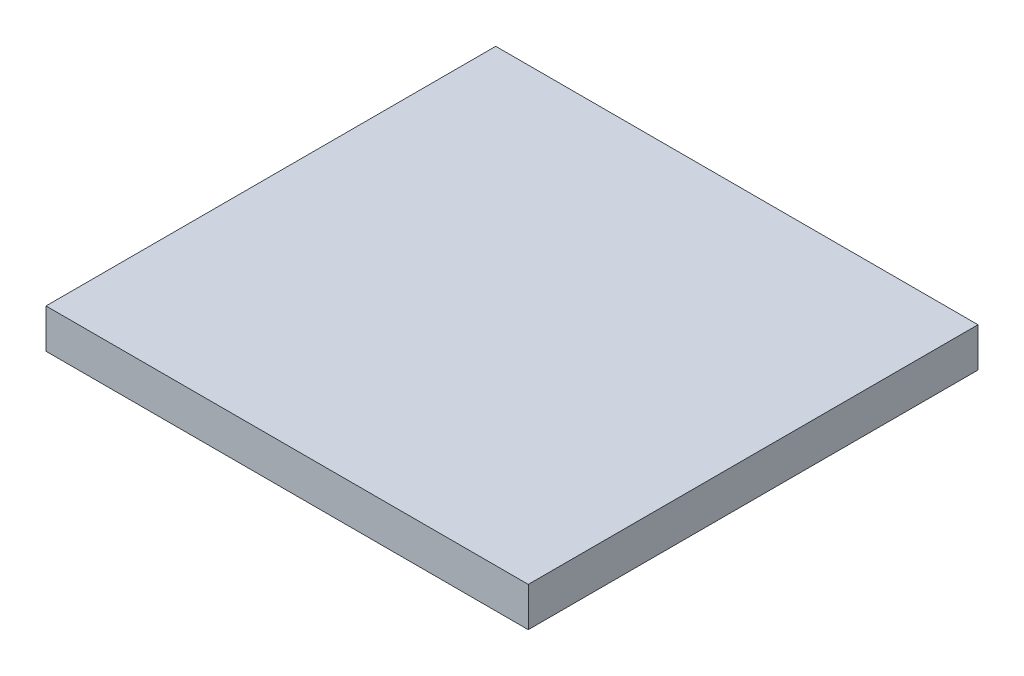
ISO-10303-21;
HEADER;
FILE_DESCRIPTION(('STEP AP214'),'2;1');
FILE_NAME('part.step','',(''),(''),'','','');
FILE_SCHEMA(('AUTOMOTIVE_DESIGN { 1 0 10303 214 1 1 1 1 }'));
ENDSEC;
DATA;
#1=APPLICATION_CONTEXT('core data for automotive mechanical design processes');
#2=APPLICATION_PROTOCOL_DEFINITION('international standard','automotive_design',2000,#1);
#3=PRODUCT_CONTEXT('',#1,'mechanical');
#4=PRODUCT('Part','Part','',(#3));
#5=PRODUCT_RELATED_PRODUCT_CATEGORY('part','',(#4));
#6=PRODUCT_DEFINITION_FORMATION('','',#4);
#7=PRODUCT_DEFINITION_CONTEXT('part definition',#1,'design');
#8=PRODUCT_DEFINITION('design','',#6,#7);
#9=PRODUCT_DEFINITION_SHAPE('','',#8);
#10=(LENGTH_UNIT() NAMED_UNIT(*) SI_UNIT(.MILLI.,.METRE.));
#11=(NAMED_UNIT(*) PLANE_ANGLE_UNIT() SI_UNIT($,.RADIAN.));
#12=(NAMED_UNIT(*) SI_UNIT($,.STERADIAN.) SOLID_ANGLE_UNIT());
#13=UNCERTAINTY_MEASURE_WITH_UNIT(LENGTH_MEASURE(1.E-05),#10,'distance_accuracy_value','');
#14=(GEOMETRIC_REPRESENTATION_CONTEXT(3) GLOBAL_UNCERTAINTY_ASSIGNED_CONTEXT((#13)) GLOBAL_UNIT_ASSIGNED_CONTEXT((#10,
#11,#12)) REPRESENTATION_CONTEXT('',''));
#15=CARTESIAN_POINT('',(0.,0.,0.));
#16=DIRECTION('',(0.,0.,1.));
#17=DIRECTION('',(1.,0.,0.));
#18=AXIS2_PLACEMENT_3D('',#15,#16,#17);
#19=CARTESIAN_POINT('',(2.15000332,0.17499584,0.));
#20=DIRECTION('',(-1.77209237826176E-06,-0.99999999999843,0.));
#21=DIRECTION('',(0.99999999999843,-1.77209237826176E-06,0.));
#22=AXIS2_PLACEMENT_3D('',#19,#20,#21);
#23=PLANE('',#22);
#24=DIRECTION('',(0.,0.,1.));
#25=VECTOR('',#24,1.);
#26=CARTESIAN_POINT('',(-2.14999824,0.17500346,0.));
#27=LINE('',#26,#25);
#28=CARTESIAN_POINT('',(-2.14999951,0.175003460002244,0.));
#29=VERTEX_POINT('',#28);
#30=CARTESIAN_POINT('',(-2.14999951,0.175003460002244,4.0099996));
#31=VERTEX_POINT('',#30);
#32=EDGE_CURVE('E47',#29,#31,#27,.T.);
#33=ORIENTED_EDGE('',*,*,#32,.T.);
#34=DIRECTION('',(0.99999999999843,-1.77209237826176E-06,0.));
#35=VECTOR('',#34,1.);
#36=CARTESIAN_POINT('',(2.15000332,0.17499584,4.0099996));
#37=LINE('',#36,#35);
#38=CARTESIAN_POINT('',(2.15000332,0.17499584,4.0099996));
#39=VERTEX_POINT('',#38);
#40=EDGE_CURVE('E19',#31,#39,#37,.T.);
#41=ORIENTED_EDGE('',*,*,#40,.T.);
#42=DIRECTION('',(0.,0.,1.));
#43=VECTOR('',#42,1.);
#44=CARTESIAN_POINT('',(2.15000332,0.17499584,0.));
#45=LINE('',#44,#43);
#46=CARTESIAN_POINT('',(2.15000332,0.17499584,0.));
#47=VERTEX_POINT('',#46);
#48=EDGE_CURVE('E52',#39,#47,#45,.F.);
#49=ORIENTED_EDGE('',*,*,#48,.T.);
#50=DIRECTION('',(0.99999999999843,-1.77209237826176E-06,0.));
#51=VECTOR('',#50,1.);
#52=CARTESIAN_POINT('',(2.15000332,0.17499584,0.));
#53=LINE('',#52,#51);
#54=EDGE_CURVE('E79',#29,#47,#53,.T.);
#55=ORIENTED_EDGE('',*,*,#54,.F.);
#56=EDGE_LOOP('',(#33,#41,#49,#55));
#57=FACE_BOUND('',#56,.T.);
#58=ADVANCED_FACE('F16',(#57),#23,.F.);
#59=CARTESIAN_POINT('',(-2.14999824,0.17500346,0.));
#60=DIRECTION('',(0.999999999973667,-7.25710469673359E-06,0.));
#61=DIRECTION('',(7.25710469673359E-06,0.999999999973667,0.));
#62=AXIS2_PLACEMENT_3D('',#59,#60,#61);
#63=PLANE('',#62);
#64=DIRECTION('',(0.,0.,1.));
#65=VECTOR('',#64,1.);
#66=CARTESIAN_POINT('',(-2.15000078,-0.17499838,0.));
#67=LINE('',#66,#65);
#68=CARTESIAN_POINT('',(-2.15000078,-0.174999015,0.));
#69=VERTEX_POINT('',#68);
#70=CARTESIAN_POINT('',(-2.15000077999987,-0.174998591666667,4.0099996));
#71=VERTEX_POINT('',#70);
#72=EDGE_CURVE('E74',#69,#71,#67,.T.);
#73=ORIENTED_EDGE('',*,*,#72,.T.);
#74=DIRECTION('',(0.,1.,0.));
#75=VECTOR('',#74,1.);
#76=CARTESIAN_POINT('',(-2.15000078,0.17499584,4.0099996));
#77=LINE('',#76,#75);
#78=EDGE_CURVE('E64',#71,#31,#77,.T.);
#79=ORIENTED_EDGE('',*,*,#78,.T.);
#80=ORIENTED_EDGE('',*,*,#32,.F.);
#81=DIRECTION('',(0.,1.,0.));
#82=VECTOR('',#81,1.);
#83=CARTESIAN_POINT('',(-2.15000078,0.17499584,0.));
#84=LINE('',#83,#82);
#85=EDGE_CURVE('E78',#69,#29,#84,.T.);
#86=ORIENTED_EDGE('',*,*,#85,.F.);
#87=EDGE_LOOP('',(#73,#79,#80,#86));
#88=FACE_BOUND('',#87,.T.);
#89=ADVANCED_FACE('F77',(#88),#63,.F.);
#90=CARTESIAN_POINT('',(2.15000332,0.17499584,4.0099996));
#91=DIRECTION('',(0.,0.,-1.));
#92=DIRECTION('',(-1.,0.,0.));
#93=AXIS2_PLACEMENT_3D('',#90,#91,#92);
#94=PLANE('',#93);
#95=ORIENTED_EDGE('',*,*,#78,.F.);
#96=DIRECTION('',(-0.999999999999826,5.90697110497297E-07,0.));
#97=VECTOR('',#96,1.);
#98=CARTESIAN_POINT('',(-2.15000078,-0.17499838,4.0099996));
#99=LINE('',#98,#97);
#100=CARTESIAN_POINT('',(2.15000332,-0.175000919999997,4.0099996));
#101=VERTEX_POINT('',#100);
#102=EDGE_CURVE('E68',#71,#101,#99,.F.);
#103=ORIENTED_EDGE('',*,*,#102,.T.);
#104=DIRECTION('',(0.,1.,0.));
#105=VECTOR('',#104,1.);
#106=CARTESIAN_POINT('',(2.15000332,0.17499584,4.0099996));
#107=LINE('',#106,#105);
#108=EDGE_CURVE('E90',#101,#39,#107,.T.);
#109=ORIENTED_EDGE('',*,*,#108,.T.);
#110=ORIENTED_EDGE('',*,*,#40,.F.);
#111=EDGE_LOOP('',(#95,#103,#109,#110));
#112=FACE_BOUND('',#111,.T.);
#113=ADVANCED_FACE('F66',(#112),#94,.F.);
#114=CARTESIAN_POINT('',(2.15000332,-0.17500092,0.));
#115=DIRECTION('',(-1.,0.,0.));
#116=DIRECTION('',(0.,0.,1.));
#117=AXIS2_PLACEMENT_3D('',#114,#115,#116);
#118=PLANE('',#117);
#119=ORIENTED_EDGE('',*,*,#48,.F.);
#120=ORIENTED_EDGE('',*,*,#108,.F.);
#121=DIRECTION('',(0.,0.,1.));
#122=VECTOR('',#121,1.);
#123=CARTESIAN_POINT('',(2.15000332,-0.175000919999997,0.));
#124=LINE('',#123,#122);
#125=CARTESIAN_POINT('',(2.15000332,-0.175000919999997,0.));
#126=VERTEX_POINT('',#125);
#127=EDGE_CURVE('E25',#101,#126,#124,.F.);
#128=ORIENTED_EDGE('',*,*,#127,.T.);
#129=DIRECTION('',(0.,1.,0.));
#130=VECTOR('',#129,1.);
#131=CARTESIAN_POINT('',(2.15000332,0.17499584,0.));
#132=LINE('',#131,#130);
#133=EDGE_CURVE('E33',#47,#126,#132,.F.);
#134=ORIENTED_EDGE('',*,*,#133,.F.);
#135=EDGE_LOOP('',(#119,#120,#128,#134));
#136=FACE_BOUND('',#135,.T.);
#137=ADVANCED_FACE('F97',(#136),#118,.F.);
#138=CARTESIAN_POINT('',(2.15000332,0.17499584,0.));
#139=DIRECTION('',(0.,0.,-1.));
#140=DIRECTION('',(-1.,0.,0.));
#141=AXIS2_PLACEMENT_3D('',#138,#139,#140);
#142=PLANE('',#141);
#143=ORIENTED_EDGE('',*,*,#85,.T.);
#144=ORIENTED_EDGE('',*,*,#54,.T.);
#145=ORIENTED_EDGE('',*,*,#133,.T.);
#146=DIRECTION('',(-0.999999999999826,5.90697110497297E-07,0.));
#147=VECTOR('',#146,1.);
#148=CARTESIAN_POINT('',(-2.15000078,-0.17499838,0.));
#149=LINE('',#148,#147);
#150=EDGE_CURVE('E11',#126,#69,#149,.T.);
#151=ORIENTED_EDGE('',*,*,#150,.T.);
#152=EDGE_LOOP('',(#143,#144,#145,#151));
#153=FACE_BOUND('',#152,.T.);
#154=ADVANCED_FACE('F99',(#153),#142,.T.);
#155=CARTESIAN_POINT('',(-2.15000078,-0.17499838,0.));
#156=DIRECTION('',(5.90697110497297E-07,0.999999999999826,0.));
#157=DIRECTION('',(-0.999999999999826,5.90697110497297E-07,0.));
#158=AXIS2_PLACEMENT_3D('',#155,#156,#157);
#159=PLANE('',#158);
#160=ORIENTED_EDGE('',*,*,#127,.F.);
#161=ORIENTED_EDGE('',*,*,#102,.F.);
#162=ORIENTED_EDGE('',*,*,#72,.F.);
#163=ORIENTED_EDGE('',*,*,#150,.F.);
#164=EDGE_LOOP('',(#160,#161,#162,#163));
#165=FACE_BOUND('',#164,.T.);
#166=ADVANCED_FACE('F73',(#165),#159,.F.);
#167=CLOSED_SHELL('',(#58,#89,#113,#137,#154,#166));
#168=MANIFOLD_SOLID_BREP('B1',#167);
#169=ADVANCED_BREP_SHAPE_REPRESENTATION('',(#18,#168),#14);
#170=SHAPE_DEFINITION_REPRESENTATION(#9,#169);
ENDSEC;
END-ISO-10303-21;
